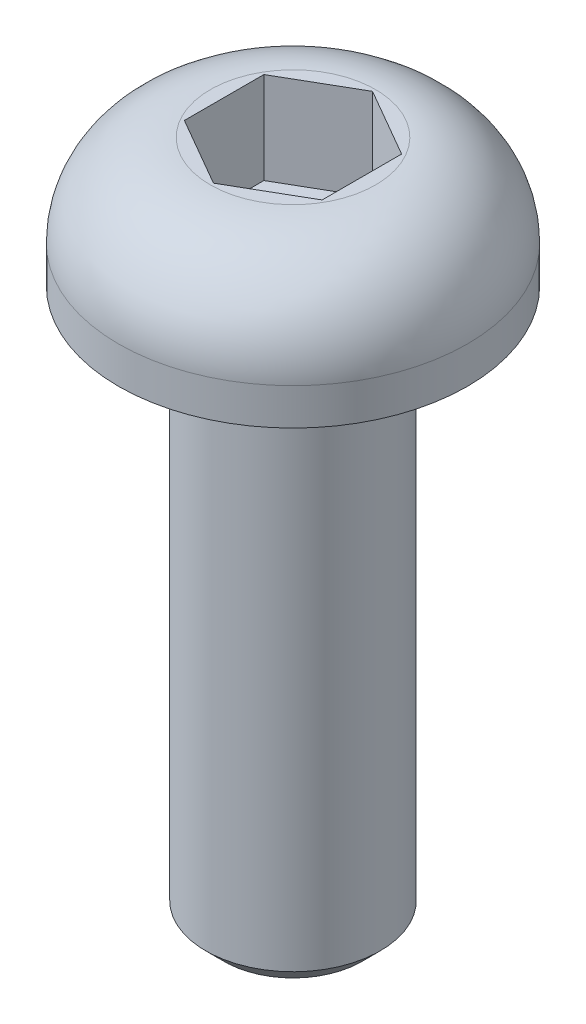
ISO-10303-21;
HEADER;
FILE_DESCRIPTION(('STEP AP214'),'2;1');
FILE_NAME('part.step','',(''),(''),'','','');
FILE_SCHEMA(('AUTOMOTIVE_DESIGN { 1 0 10303 214 1 1 1 1 }'));
ENDSEC;
DATA;
#1=APPLICATION_CONTEXT('core data for automotive mechanical design processes');
#2=APPLICATION_PROTOCOL_DEFINITION('international standard','automotive_design',2000,#1);
#3=PRODUCT_CONTEXT('',#1,'mechanical');
#4=PRODUCT('Part','Part','',(#3));
#5=PRODUCT_RELATED_PRODUCT_CATEGORY('part','',(#4));
#6=PRODUCT_DEFINITION_FORMATION('','',#4);
#7=PRODUCT_DEFINITION_CONTEXT('part definition',#1,'design');
#8=PRODUCT_DEFINITION('design','',#6,#7);
#9=PRODUCT_DEFINITION_SHAPE('','',#8);
#10=(LENGTH_UNIT() NAMED_UNIT(*) SI_UNIT(.MILLI.,.METRE.));
#11=(NAMED_UNIT(*) PLANE_ANGLE_UNIT() SI_UNIT($,.RADIAN.));
#12=(NAMED_UNIT(*) SI_UNIT($,.STERADIAN.) SOLID_ANGLE_UNIT());
#13=UNCERTAINTY_MEASURE_WITH_UNIT(LENGTH_MEASURE(1.E-05),#10,'distance_accuracy_value','');
#14=(GEOMETRIC_REPRESENTATION_CONTEXT(3) GLOBAL_UNCERTAINTY_ASSIGNED_CONTEXT((#13)) GLOBAL_UNIT_ASSIGNED_CONTEXT((#10,
#11,#12)) REPRESENTATION_CONTEXT('',''));
#15=CARTESIAN_POINT('',(0.,0.,0.));
#16=DIRECTION('',(0.,0.,1.));
#17=DIRECTION('',(1.,0.,0.));
#18=AXIS2_PLACEMENT_3D('',#15,#16,#17);
#19=CARTESIAN_POINT('',(0.,1.4,0.));
#20=DIRECTION('',(0.,-1.,0.));
#21=DIRECTION('',(0.,0.,-1.));
#22=AXIS2_PLACEMENT_3D('',#19,#20,#21);
#23=CYLINDRICAL_SURFACE('',#22,1.9);
#24=CARTESIAN_POINT('',(0.,0.4,0.));
#25=DIRECTION('',(0.,1.,0.));
#26=DIRECTION('',(0.,0.,1.));
#27=AXIS2_PLACEMENT_3D('',#24,#25,#26);
#28=CIRCLE('',#27,1.9);
#29=CARTESIAN_POINT('',(0.,0.4,1.9));
#30=VERTEX_POINT('',#29);
#31=EDGE_CURVE('E174',#30,#30,#28,.F.);
#32=ORIENTED_EDGE('',*,*,#31,.T.);
#33=EDGE_LOOP('',(#32));
#34=FACE_BOUND('',#33,.T.);
#35=CARTESIAN_POINT('',(0.,0.,0.));
#36=DIRECTION('',(0.,1.,0.));
#37=DIRECTION('',(0.,0.,1.));
#38=AXIS2_PLACEMENT_3D('',#35,#36,#37);
#39=CIRCLE('',#38,1.9);
#40=CARTESIAN_POINT('',(0.,0.,1.9));
#41=VERTEX_POINT('',#40);
#42=EDGE_CURVE('E157',#41,#41,#39,.T.);
#43=ORIENTED_EDGE('',*,*,#42,.T.);
#44=EDGE_LOOP('',(#43));
#45=FACE_BOUND('',#44,.T.);
#46=ADVANCED_FACE('F41',(#34,#45),#23,.T.);
#47=CARTESIAN_POINT('',(0.,1.4,0.));
#48=DIRECTION('',(0.,1.,0.));
#49=DIRECTION('',(0.,0.,1.));
#50=AXIS2_PLACEMENT_3D('',#47,#48,#49);
#51=PLANE('',#50);
#52=CARTESIAN_POINT('',(0.,1.4,0.));
#53=DIRECTION('',(0.,1.,0.));
#54=DIRECTION('',(0.,0.,1.));
#55=AXIS2_PLACEMENT_3D('',#52,#53,#54);
#56=CIRCLE('',#55,0.9);
#57=CARTESIAN_POINT('',(0.,1.4,0.9));
#58=VERTEX_POINT('',#57);
#59=EDGE_CURVE('E170',#58,#58,#56,.T.);
#60=ORIENTED_EDGE('',*,*,#59,.T.);
#61=EDGE_LOOP('',(#60));
#62=FACE_BOUND('',#61,.T.);
#63=DIRECTION('',(0.866025403784439,0.,0.5));
#64=VECTOR('',#63,1.);
#65=CARTESIAN_POINT('',(-0.75,1.4,0.433012701892219));
#66=LINE('',#65,#64);
#67=CARTESIAN_POINT('',(-0.75,1.4,0.433012701892219));
#68=VERTEX_POINT('',#67);
#69=CARTESIAN_POINT('',(0.,1.4,0.866025403784439));
#70=VERTEX_POINT('',#69);
#71=EDGE_CURVE('E58',#68,#70,#66,.T.);
#72=ORIENTED_EDGE('',*,*,#71,.F.);
#73=DIRECTION('',(0.,0.,1.));
#74=VECTOR('',#73,1.);
#75=CARTESIAN_POINT('',(-0.75,1.4,-0.43301270189222));
#76=LINE('',#75,#74);
#77=CARTESIAN_POINT('',(-0.75,1.4,-0.43301270189222));
#78=VERTEX_POINT('',#77);
#79=EDGE_CURVE('E151',#78,#68,#76,.T.);
#80=ORIENTED_EDGE('',*,*,#79,.F.);
#81=DIRECTION('',(-0.866025403784439,0.,0.5));
#82=VECTOR('',#81,1.);
#83=CARTESIAN_POINT('',(0.,1.4,-0.866025403784439));
#84=LINE('',#83,#82);
#85=CARTESIAN_POINT('',(0.,1.4,-0.866025403784439));
#86=VERTEX_POINT('',#85);
#87=EDGE_CURVE('E148',#86,#78,#84,.T.);
#88=ORIENTED_EDGE('',*,*,#87,.F.);
#89=DIRECTION('',(-0.866025403784439,0.,-0.5));
#90=VECTOR('',#89,1.);
#91=CARTESIAN_POINT('',(0.75,1.4,-0.43301270189222));
#92=LINE('',#91,#90);
#93=CARTESIAN_POINT('',(0.75,1.4,-0.43301270189222));
#94=VERTEX_POINT('',#93);
#95=EDGE_CURVE('E106',#94,#86,#92,.T.);
#96=ORIENTED_EDGE('',*,*,#95,.F.);
#97=DIRECTION('',(0.,0.,-1.));
#98=VECTOR('',#97,1.);
#99=CARTESIAN_POINT('',(0.75,1.4,0.43301270189222));
#100=LINE('',#99,#98);
#101=CARTESIAN_POINT('',(0.75,1.4,0.43301270189222));
#102=VERTEX_POINT('',#101);
#103=EDGE_CURVE('E142',#102,#94,#100,.T.);
#104=ORIENTED_EDGE('',*,*,#103,.F.);
#105=DIRECTION('',(0.866025403784439,0.,-0.5));
#106=VECTOR('',#105,1.);
#107=CARTESIAN_POINT('',(0.,1.4,0.866025403784439));
#108=LINE('',#107,#106);
#109=EDGE_CURVE('E138',#70,#102,#108,.T.);
#110=ORIENTED_EDGE('',*,*,#109,.F.);
#111=EDGE_LOOP('',(#72,#80,#88,#96,#104,#110));
#112=FACE_BOUND('',#111,.T.);
#113=ADVANCED_FACE('F197',(#62,#112),#51,.T.);
#114=CARTESIAN_POINT('',(0.,0.,0.));
#115=DIRECTION('',(0.,1.,0.));
#116=DIRECTION('',(0.,0.,1.));
#117=AXIS2_PLACEMENT_3D('',#114,#115,#116);
#118=PLANE('',#117);
#119=CARTESIAN_POINT('',(0.,0.,0.));
#120=DIRECTION('',(0.,-1.,0.));
#121=DIRECTION('',(0.,0.,-1.));
#122=AXIS2_PLACEMENT_3D('',#119,#120,#121);
#123=CIRCLE('',#122,0.95);
#124=CARTESIAN_POINT('',(0.,0.,-0.95));
#125=VERTEX_POINT('',#124);
#126=EDGE_CURVE('E177',#125,#125,#123,.T.);
#127=ORIENTED_EDGE('',*,*,#126,.F.);
#128=EDGE_LOOP('',(#127));
#129=FACE_BOUND('',#128,.T.);
#130=ORIENTED_EDGE('',*,*,#42,.F.);
#131=EDGE_LOOP('',(#130));
#132=FACE_BOUND('',#131,.T.);
#133=ADVANCED_FACE('F208',(#129,#132),#118,.F.);
#134=CARTESIAN_POINT('',(-0.75,0.4,0.433012701892219));
#135=DIRECTION('',(-0.5,0.,0.866025403784439));
#136=DIRECTION('',(0.866025403784439,0.,0.5));
#137=AXIS2_PLACEMENT_3D('',#134,#135,#136);
#138=PLANE('',#137);
#139=ORIENTED_EDGE('',*,*,#71,.T.);
#140=DIRECTION('',(0.,1.,0.));
#141=VECTOR('',#140,1.);
#142=CARTESIAN_POINT('',(0.,0.4,0.866025403784439));
#143=LINE('',#142,#141);
#144=CARTESIAN_POINT('',(0.,0.4,0.866025403784439));
#145=VERTEX_POINT('',#144);
#146=EDGE_CURVE('E88',#145,#70,#143,.T.);
#147=ORIENTED_EDGE('',*,*,#146,.F.);
#148=DIRECTION('',(0.866025403784439,0.,0.5));
#149=VECTOR('',#148,1.);
#150=CARTESIAN_POINT('',(-0.75,0.4,0.433012701892219));
#151=LINE('',#150,#149);
#152=CARTESIAN_POINT('',(-0.75,0.4,0.433012701892219));
#153=VERTEX_POINT('',#152);
#154=EDGE_CURVE('E154',#153,#145,#151,.T.);
#155=ORIENTED_EDGE('',*,*,#154,.F.);
#156=DIRECTION('',(0.,1.,0.));
#157=VECTOR('',#156,1.);
#158=CARTESIAN_POINT('',(-0.75,0.4,0.433012701892219));
#159=LINE('',#158,#157);
#160=EDGE_CURVE('E66',#153,#68,#159,.T.);
#161=ORIENTED_EDGE('',*,*,#160,.T.);
#162=EDGE_LOOP('',(#139,#147,#155,#161));
#163=FACE_BOUND('',#162,.T.);
#164=ADVANCED_FACE('F201',(#163),#138,.F.);
#165=CARTESIAN_POINT('',(-0.75,0.4,-0.43301270189222));
#166=DIRECTION('',(-1.,0.,0.));
#167=DIRECTION('',(0.,0.,1.));
#168=AXIS2_PLACEMENT_3D('',#165,#166,#167);
#169=PLANE('',#168);
#170=ORIENTED_EDGE('',*,*,#79,.T.);
#171=ORIENTED_EDGE('',*,*,#160,.F.);
#172=DIRECTION('',(0.,0.,1.));
#173=VECTOR('',#172,1.);
#174=CARTESIAN_POINT('',(-0.75,0.4,-0.43301270189222));
#175=LINE('',#174,#173);
#176=CARTESIAN_POINT('',(-0.75,0.4,-0.43301270189222));
#177=VERTEX_POINT('',#176);
#178=EDGE_CURVE('E120',#177,#153,#175,.T.);
#179=ORIENTED_EDGE('',*,*,#178,.F.);
#180=DIRECTION('',(0.,1.,0.));
#181=VECTOR('',#180,1.);
#182=CARTESIAN_POINT('',(-0.75,0.4,-0.43301270189222));
#183=LINE('',#182,#181);
#184=EDGE_CURVE('E111',#177,#78,#183,.T.);
#185=ORIENTED_EDGE('',*,*,#184,.T.);
#186=EDGE_LOOP('',(#170,#171,#179,#185));
#187=FACE_BOUND('',#186,.T.);
#188=ADVANCED_FACE('F199',(#187),#169,.F.);
#189=CARTESIAN_POINT('',(0.,0.4,-0.866025403784439));
#190=DIRECTION('',(-0.5,0.,-0.866025403784439));
#191=DIRECTION('',(-0.866025403784439,0.,0.5));
#192=AXIS2_PLACEMENT_3D('',#189,#190,#191);
#193=PLANE('',#192);
#194=ORIENTED_EDGE('',*,*,#87,.T.);
#195=ORIENTED_EDGE('',*,*,#184,.F.);
#196=DIRECTION('',(-0.866025403784439,0.,0.5));
#197=VECTOR('',#196,1.);
#198=CARTESIAN_POINT('',(0.,0.4,-0.866025403784439));
#199=LINE('',#198,#197);
#200=CARTESIAN_POINT('',(0.,0.4,-0.866025403784439));
#201=VERTEX_POINT('',#200);
#202=EDGE_CURVE('E115',#201,#177,#199,.T.);
#203=ORIENTED_EDGE('',*,*,#202,.F.);
#204=DIRECTION('',(0.,1.,0.));
#205=VECTOR('',#204,1.);
#206=CARTESIAN_POINT('',(0.,0.4,-0.866025403784439));
#207=LINE('',#206,#205);
#208=EDGE_CURVE('E99',#201,#86,#207,.T.);
#209=ORIENTED_EDGE('',*,*,#208,.T.);
#210=EDGE_LOOP('',(#194,#195,#203,#209));
#211=FACE_BOUND('',#210,.T.);
#212=ADVANCED_FACE('F116',(#211),#193,.F.);
#213=CARTESIAN_POINT('',(0.75,0.4,-0.43301270189222));
#214=DIRECTION('',(0.5,0.,-0.866025403784439));
#215=DIRECTION('',(-0.866025403784439,0.,-0.5));
#216=AXIS2_PLACEMENT_3D('',#213,#214,#215);
#217=PLANE('',#216);
#218=ORIENTED_EDGE('',*,*,#95,.T.);
#219=ORIENTED_EDGE('',*,*,#208,.F.);
#220=DIRECTION('',(-0.866025403784439,0.,-0.5));
#221=VECTOR('',#220,1.);
#222=CARTESIAN_POINT('',(0.75,0.4,-0.43301270189222));
#223=LINE('',#222,#221);
#224=CARTESIAN_POINT('',(0.75,0.4,-0.43301270189222));
#225=VERTEX_POINT('',#224);
#226=EDGE_CURVE('E103',#225,#201,#223,.T.);
#227=ORIENTED_EDGE('',*,*,#226,.F.);
#228=DIRECTION('',(0.,1.,0.));
#229=VECTOR('',#228,1.);
#230=CARTESIAN_POINT('',(0.75,0.4,-0.43301270189222));
#231=LINE('',#230,#229);
#232=EDGE_CURVE('E112',#225,#94,#231,.T.);
#233=ORIENTED_EDGE('',*,*,#232,.T.);
#234=EDGE_LOOP('',(#218,#219,#227,#233));
#235=FACE_BOUND('',#234,.T.);
#236=ADVANCED_FACE('F101',(#235),#217,.F.);
#237=CARTESIAN_POINT('',(0.75,0.4,0.43301270189222));
#238=DIRECTION('',(1.,0.,0.));
#239=DIRECTION('',(0.,0.,-1.));
#240=AXIS2_PLACEMENT_3D('',#237,#238,#239);
#241=PLANE('',#240);
#242=ORIENTED_EDGE('',*,*,#103,.T.);
#243=ORIENTED_EDGE('',*,*,#232,.F.);
#244=DIRECTION('',(0.,0.,-1.));
#245=VECTOR('',#244,1.);
#246=CARTESIAN_POINT('',(0.75,0.4,0.43301270189222));
#247=LINE('',#246,#245);
#248=CARTESIAN_POINT('',(0.75,0.4,0.43301270189222));
#249=VERTEX_POINT('',#248);
#250=EDGE_CURVE('E126',#249,#225,#247,.T.);
#251=ORIENTED_EDGE('',*,*,#250,.F.);
#252=DIRECTION('',(0.,1.,0.));
#253=VECTOR('',#252,1.);
#254=CARTESIAN_POINT('',(0.75,0.4,0.43301270189222));
#255=LINE('',#254,#253);
#256=EDGE_CURVE('E162',#249,#102,#255,.T.);
#257=ORIENTED_EDGE('',*,*,#256,.T.);
#258=EDGE_LOOP('',(#242,#243,#251,#257));
#259=FACE_BOUND('',#258,.T.);
#260=ADVANCED_FACE('F195',(#259),#241,.F.);
#261=CARTESIAN_POINT('',(0.,0.4,0.866025403784439));
#262=DIRECTION('',(0.5,0.,0.866025403784439));
#263=DIRECTION('',(0.866025403784439,0.,-0.5));
#264=AXIS2_PLACEMENT_3D('',#261,#262,#263);
#265=PLANE('',#264);
#266=ORIENTED_EDGE('',*,*,#109,.T.);
#267=ORIENTED_EDGE('',*,*,#256,.F.);
#268=DIRECTION('',(0.866025403784439,0.,-0.5));
#269=VECTOR('',#268,1.);
#270=CARTESIAN_POINT('',(0.,0.4,0.866025403784439));
#271=LINE('',#270,#269);
#272=EDGE_CURVE('E130',#145,#249,#271,.T.);
#273=ORIENTED_EDGE('',*,*,#272,.F.);
#274=ORIENTED_EDGE('',*,*,#146,.T.);
#275=EDGE_LOOP('',(#266,#267,#273,#274));
#276=FACE_BOUND('',#275,.T.);
#277=ADVANCED_FACE('F191',(#276),#265,.F.);
#278=CARTESIAN_POINT('',(0.,0.4,0.));
#279=DIRECTION('',(0.,1.,0.));
#280=DIRECTION('',(0.,0.,1.));
#281=AXIS2_PLACEMENT_3D('',#278,#279,#280);
#282=PLANE('',#281);
#283=ORIENTED_EDGE('',*,*,#154,.T.);
#284=ORIENTED_EDGE('',*,*,#272,.T.);
#285=ORIENTED_EDGE('',*,*,#250,.T.);
#286=ORIENTED_EDGE('',*,*,#226,.T.);
#287=ORIENTED_EDGE('',*,*,#202,.T.);
#288=ORIENTED_EDGE('',*,*,#178,.T.);
#289=EDGE_LOOP('',(#283,#284,#285,#286,#287,#288));
#290=FACE_BOUND('',#289,.T.);
#291=ADVANCED_FACE('F123',(#290),#282,.T.);
#292=CARTESIAN_POINT('',(0.,0.4,0.));
#293=DIRECTION('',(0.,1.,0.));
#294=DIRECTION('',(0.,0.,1.));
#295=AXIS2_PLACEMENT_3D('',#292,#293,#294);
#296=DEGENERATE_TOROIDAL_SURFACE('',#295,0.9,1.,.T.);
#297=ORIENTED_EDGE('',*,*,#31,.F.);
#298=EDGE_LOOP('',(#297));
#299=FACE_BOUND('',#298,.T.);
#300=ORIENTED_EDGE('',*,*,#59,.F.);
#301=EDGE_LOOP('',(#300));
#302=FACE_BOUND('',#301,.T.);
#303=ADVANCED_FACE('F221',(#299,#302),#296,.T.);
#304=CARTESIAN_POINT('',(0.,-6.,0.));
#305=DIRECTION('',(0.,1.,0.));
#306=DIRECTION('',(0.,0.,1.));
#307=AXIS2_PLACEMENT_3D('',#304,#305,#306);
#308=CYLINDRICAL_SURFACE('',#307,0.95);
#309=CARTESIAN_POINT('',(0.,-5.8,0.));
#310=DIRECTION('',(0.,-1.,0.));
#311=DIRECTION('',(0.,0.,-1.));
#312=AXIS2_PLACEMENT_3D('',#309,#310,#311);
#313=CIRCLE('',#312,0.95);
#314=CARTESIAN_POINT('',(0.,-5.8,-0.95));
#315=VERTEX_POINT('',#314);
#316=EDGE_CURVE('E11',#315,#315,#313,.F.);
#317=ORIENTED_EDGE('',*,*,#316,.T.);
#318=EDGE_LOOP('',(#317));
#319=FACE_BOUND('',#318,.T.);
#320=ORIENTED_EDGE('',*,*,#126,.T.);
#321=EDGE_LOOP('',(#320));
#322=FACE_BOUND('',#321,.T.);
#323=ADVANCED_FACE('F223',(#319,#322),#308,.T.);
#324=CARTESIAN_POINT('',(0.,-6.,0.));
#325=DIRECTION('',(0.,-1.,0.));
#326=DIRECTION('',(0.,0.,-1.));
#327=AXIS2_PLACEMENT_3D('',#324,#325,#326);
#328=PLANE('',#327);
#329=CARTESIAN_POINT('',(0.,-6.,0.));
#330=DIRECTION('',(0.,-1.,0.));
#331=DIRECTION('',(0.,0.,-1.));
#332=AXIS2_PLACEMENT_3D('',#329,#330,#331);
#333=CIRCLE('',#332,0.750000000000001);
#334=CARTESIAN_POINT('',(0.,-6.,-0.750000000000001));
#335=VERTEX_POINT('',#334);
#336=EDGE_CURVE('E51',#335,#335,#333,.T.);
#337=ORIENTED_EDGE('',*,*,#336,.T.);
#338=EDGE_LOOP('',(#337));
#339=FACE_BOUND('',#338,.T.);
#340=ADVANCED_FACE('F229',(#339),#328,.T.);
#341=CARTESIAN_POINT('',(0.,-6.,0.));
#342=DIRECTION('',(0.,1.,0.));
#343=DIRECTION('',(0.,0.,1.));
#344=AXIS2_PLACEMENT_3D('',#341,#342,#343);
#345=CONICAL_SURFACE('',#344,0.750000000000001,0.785398163397448);
#346=ORIENTED_EDGE('',*,*,#316,.F.);
#347=EDGE_LOOP('',(#346));
#348=FACE_BOUND('',#347,.T.);
#349=ORIENTED_EDGE('',*,*,#336,.F.);
#350=EDGE_LOOP('',(#349));
#351=FACE_BOUND('',#350,.T.);
#352=ADVANCED_FACE('F44',(#348,#351),#345,.T.);
#353=CLOSED_SHELL('',(#46,#113,#133,#164,#188,#212,#236,#260,#277,#291,#303,#323,#340,#352));
#354=MANIFOLD_SOLID_BREP('B2',#353);
#355=ADVANCED_BREP_SHAPE_REPRESENTATION('',(#18,#354),#14);
#356=SHAPE_DEFINITION_REPRESENTATION(#9,#355);
ENDSEC;
END-ISO-10303-21;
